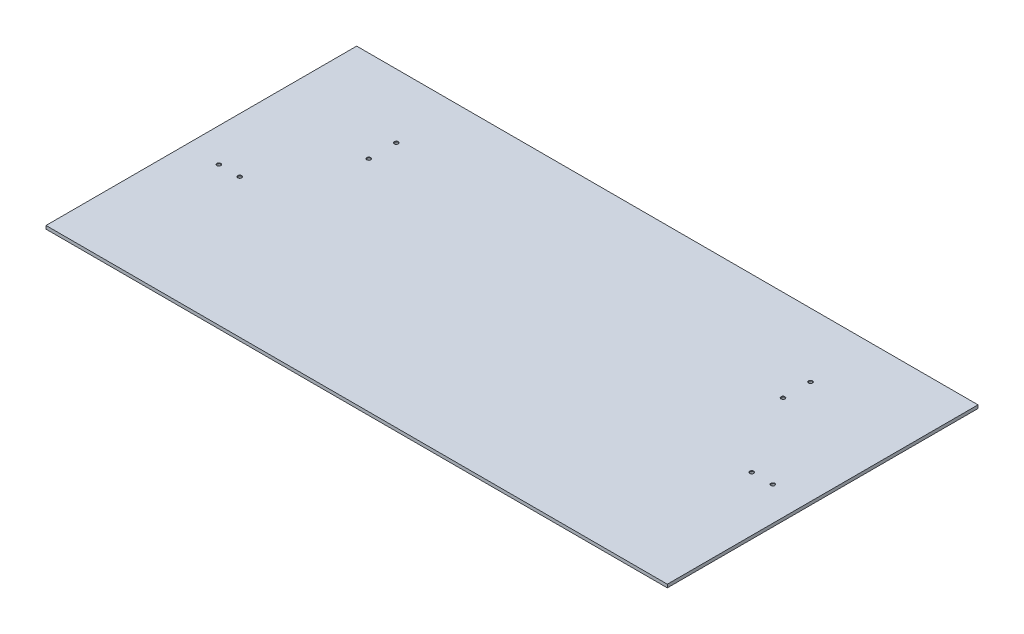
ISO-10303-21;
HEADER;
FILE_DESCRIPTION(('STEP AP214'),'2;1');
FILE_NAME('part.step','',(''),(''),'','','');
FILE_SCHEMA(('AUTOMOTIVE_DESIGN { 1 0 10303 214 1 1 1 1 }'));
ENDSEC;
DATA;
#1=APPLICATION_CONTEXT('core data for automotive mechanical design processes');
#2=APPLICATION_PROTOCOL_DEFINITION('international standard','automotive_design',2000,#1);
#3=PRODUCT_CONTEXT('',#1,'mechanical');
#4=PRODUCT('Part','Part','',(#3));
#5=PRODUCT_RELATED_PRODUCT_CATEGORY('part','',(#4));
#6=PRODUCT_DEFINITION_FORMATION('','',#4);
#7=PRODUCT_DEFINITION_CONTEXT('part definition',#1,'design');
#8=PRODUCT_DEFINITION('design','',#6,#7);
#9=PRODUCT_DEFINITION_SHAPE('','',#8);
#10=(LENGTH_UNIT() NAMED_UNIT(*) SI_UNIT(.MILLI.,.METRE.));
#11=(NAMED_UNIT(*) PLANE_ANGLE_UNIT() SI_UNIT($,.RADIAN.));
#12=(NAMED_UNIT(*) SI_UNIT($,.STERADIAN.) SOLID_ANGLE_UNIT());
#13=UNCERTAINTY_MEASURE_WITH_UNIT(LENGTH_MEASURE(1.E-05),#10,'distance_accuracy_value','');
#14=(GEOMETRIC_REPRESENTATION_CONTEXT(3) GLOBAL_UNCERTAINTY_ASSIGNED_CONTEXT((#13)) GLOBAL_UNIT_ASSIGNED_CONTEXT((#10,
#11,#12)) REPRESENTATION_CONTEXT('',''));
#15=CARTESIAN_POINT('',(0.,0.,0.));
#16=DIRECTION('',(0.,0.,1.));
#17=DIRECTION('',(1.,0.,0.));
#18=AXIS2_PLACEMENT_3D('',#15,#16,#17);
#19=CARTESIAN_POINT('',(0.,6.35,0.));
#20=DIRECTION('',(1.,0.,0.));
#21=DIRECTION('',(0.,0.,-1.));
#22=AXIS2_PLACEMENT_3D('',#19,#20,#21);
#23=PLANE('',#22);
#24=DIRECTION('',(0.,0.,1.));
#25=VECTOR('',#24,1.);
#26=CARTESIAN_POINT('',(0.,0.,0.));
#27=LINE('',#26,#25);
#28=CARTESIAN_POINT('',(0.,0.,-609.6));
#29=VERTEX_POINT('',#28);
#30=CARTESIAN_POINT('',(0.,0.,0.));
#31=VERTEX_POINT('',#30);
#32=EDGE_CURVE('E102',#29,#31,#27,.T.);
#33=ORIENTED_EDGE('',*,*,#32,.T.);
#34=DIRECTION('',(0.,-1.,0.));
#35=VECTOR('',#34,1.);
#36=CARTESIAN_POINT('',(0.,6.35,0.));
#37=LINE('',#36,#35);
#38=CARTESIAN_POINT('',(0.,6.35,0.));
#39=VERTEX_POINT('',#38);
#40=EDGE_CURVE('E11',#39,#31,#37,.T.);
#41=ORIENTED_EDGE('',*,*,#40,.F.);
#42=DIRECTION('',(0.,0.,1.));
#43=VECTOR('',#42,1.);
#44=CARTESIAN_POINT('',(0.,6.35,0.));
#45=LINE('',#44,#43);
#46=CARTESIAN_POINT('',(0.,6.35,-609.6));
#47=VERTEX_POINT('',#46);
#48=EDGE_CURVE('E90',#47,#39,#45,.T.);
#49=ORIENTED_EDGE('',*,*,#48,.F.);
#50=DIRECTION('',(0.,-1.,0.));
#51=VECTOR('',#50,1.);
#52=CARTESIAN_POINT('',(0.,6.35,-609.6));
#53=LINE('',#52,#51);
#54=EDGE_CURVE('E98',#47,#29,#53,.T.);
#55=ORIENTED_EDGE('',*,*,#54,.T.);
#56=EDGE_LOOP('',(#33,#41,#49,#55));
#57=FACE_BOUND('',#56,.T.);
#58=ADVANCED_FACE('F39',(#57),#23,.F.);
#59=CARTESIAN_POINT('',(0.,6.35,0.));
#60=DIRECTION('',(0.,0.,-1.));
#61=DIRECTION('',(-1.,0.,0.));
#62=AXIS2_PLACEMENT_3D('',#59,#60,#61);
#63=PLANE('',#62);
#64=DIRECTION('',(1.,0.,0.));
#65=VECTOR('',#64,1.);
#66=CARTESIAN_POINT('',(0.,0.,0.));
#67=LINE('',#66,#65);
#68=CARTESIAN_POINT('',(1219.2,0.,0.));
#69=VERTEX_POINT('',#68);
#70=EDGE_CURVE('E94',#31,#69,#67,.T.);
#71=ORIENTED_EDGE('',*,*,#70,.T.);
#72=DIRECTION('',(0.,-1.,0.));
#73=VECTOR('',#72,1.);
#74=CARTESIAN_POINT('',(1219.2,6.35,0.));
#75=LINE('',#74,#73);
#76=CARTESIAN_POINT('',(1219.2,6.35,0.));
#77=VERTEX_POINT('',#76);
#78=EDGE_CURVE('E47',#77,#69,#75,.T.);
#79=ORIENTED_EDGE('',*,*,#78,.F.);
#80=DIRECTION('',(1.,0.,0.));
#81=VECTOR('',#80,1.);
#82=CARTESIAN_POINT('',(0.,6.35,0.));
#83=LINE('',#82,#81);
#84=EDGE_CURVE('E85',#39,#77,#83,.T.);
#85=ORIENTED_EDGE('',*,*,#84,.F.);
#86=ORIENTED_EDGE('',*,*,#40,.T.);
#87=EDGE_LOOP('',(#71,#79,#85,#86));
#88=FACE_BOUND('',#87,.T.);
#89=ADVANCED_FACE('F93',(#88),#63,.F.);
#90=CARTESIAN_POINT('',(1219.2,6.35,0.));
#91=DIRECTION('',(-1.,0.,0.));
#92=DIRECTION('',(0.,0.,1.));
#93=AXIS2_PLACEMENT_3D('',#90,#91,#92);
#94=PLANE('',#93);
#95=DIRECTION('',(0.,0.,-1.));
#96=VECTOR('',#95,1.);
#97=CARTESIAN_POINT('',(1219.2,0.,0.));
#98=LINE('',#97,#96);
#99=CARTESIAN_POINT('',(1219.2,0.,-609.6));
#100=VERTEX_POINT('',#99);
#101=EDGE_CURVE('E72',#69,#100,#98,.T.);
#102=ORIENTED_EDGE('',*,*,#101,.T.);
#103=DIRECTION('',(0.,-1.,0.));
#104=VECTOR('',#103,1.);
#105=CARTESIAN_POINT('',(1219.2,6.35,-609.6));
#106=LINE('',#105,#104);
#107=CARTESIAN_POINT('',(1219.2,6.35,-609.6));
#108=VERTEX_POINT('',#107);
#109=EDGE_CURVE('E95',#108,#100,#106,.T.);
#110=ORIENTED_EDGE('',*,*,#109,.F.);
#111=DIRECTION('',(0.,0.,-1.));
#112=VECTOR('',#111,1.);
#113=CARTESIAN_POINT('',(1219.2,6.35,0.));
#114=LINE('',#113,#112);
#115=EDGE_CURVE('E88',#77,#108,#114,.T.);
#116=ORIENTED_EDGE('',*,*,#115,.F.);
#117=ORIENTED_EDGE('',*,*,#78,.T.);
#118=EDGE_LOOP('',(#102,#110,#116,#117));
#119=FACE_BOUND('',#118,.T.);
#120=ADVANCED_FACE('F96',(#119),#94,.F.);
#121=CARTESIAN_POINT('',(0.,6.35,-609.6));
#122=DIRECTION('',(0.,0.,1.));
#123=DIRECTION('',(1.,0.,0.));
#124=AXIS2_PLACEMENT_3D('',#121,#122,#123);
#125=PLANE('',#124);
#126=DIRECTION('',(-1.,0.,0.));
#127=VECTOR('',#126,1.);
#128=CARTESIAN_POINT('',(0.,0.,-609.6));
#129=LINE('',#128,#127);
#130=EDGE_CURVE('E78',#100,#29,#129,.T.);
#131=ORIENTED_EDGE('',*,*,#130,.T.);
#132=ORIENTED_EDGE('',*,*,#54,.F.);
#133=DIRECTION('',(-1.,0.,0.));
#134=VECTOR('',#133,1.);
#135=CARTESIAN_POINT('',(0.,6.35,-609.6));
#136=LINE('',#135,#134);
#137=EDGE_CURVE('E55',#108,#47,#136,.T.);
#138=ORIENTED_EDGE('',*,*,#137,.F.);
#139=ORIENTED_EDGE('',*,*,#109,.T.);
#140=EDGE_LOOP('',(#131,#132,#138,#139));
#141=FACE_BOUND('',#140,.T.);
#142=ADVANCED_FACE('F110',(#141),#125,.F.);
#143=CARTESIAN_POINT('',(0.,6.35,0.));
#144=DIRECTION('',(0.,-1.,0.));
#145=DIRECTION('',(0.,0.,-1.));
#146=AXIS2_PLACEMENT_3D('',#143,#144,#145);
#147=PLANE('',#146);
#148=CARTESIAN_POINT('',(66.0777190000001,6.35,-273.05));
#149=DIRECTION('',(0.,1.,0.));
#150=DIRECTION('',(0.,0.,1.));
#151=AXIS2_PLACEMENT_3D('',#148,#149,#150);
#152=CIRCLE('',#151,3.8989);
#153=CARTESIAN_POINT('',(66.0777190000001,6.35,-269.1511));
#154=VERTEX_POINT('',#153);
#155=EDGE_CURVE('E184',#154,#154,#152,.T.);
#156=ORIENTED_EDGE('',*,*,#155,.F.);
#157=EDGE_LOOP('',(#156));
#158=FACE_BOUND('',#157,.T.);
#159=CARTESIAN_POINT('',(107.352719,6.35,-273.05));
#160=DIRECTION('',(0.,1.,0.));
#161=DIRECTION('',(0.,0.,1.));
#162=AXIS2_PLACEMENT_3D('',#159,#160,#161);
#163=CIRCLE('',#162,3.8989);
#164=CARTESIAN_POINT('',(107.352719,6.35,-269.1511));
#165=VERTEX_POINT('',#164);
#166=EDGE_CURVE('E175',#165,#165,#163,.T.);
#167=ORIENTED_EDGE('',*,*,#166,.F.);
#168=EDGE_LOOP('',(#167));
#169=FACE_BOUND('',#168,.T.);
#170=CARTESIAN_POINT('',(203.2,6.35,-484.1875));
#171=DIRECTION('',(0.,1.,0.));
#172=DIRECTION('',(0.,0.,1.));
#173=AXIS2_PLACEMENT_3D('',#170,#171,#172);
#174=CIRCLE('',#173,3.89890000000001);
#175=CARTESIAN_POINT('',(203.2,6.35,-480.2886));
#176=VERTEX_POINT('',#175);
#177=EDGE_CURVE('E166',#176,#176,#174,.T.);
#178=ORIENTED_EDGE('',*,*,#177,.F.);
#179=EDGE_LOOP('',(#178));
#180=FACE_BOUND('',#179,.T.);
#181=CARTESIAN_POINT('',(203.2,6.35,-430.2125));
#182=DIRECTION('',(0.,1.,0.));
#183=DIRECTION('',(0.,0.,1.));
#184=AXIS2_PLACEMENT_3D('',#181,#182,#183);
#185=CIRCLE('',#184,3.89890000000001);
#186=CARTESIAN_POINT('',(203.2,6.35,-426.3136));
#187=VERTEX_POINT('',#186);
#188=EDGE_CURVE('E157',#187,#187,#185,.T.);
#189=ORIENTED_EDGE('',*,*,#188,.F.);
#190=EDGE_LOOP('',(#189));
#191=FACE_BOUND('',#190,.T.);
#192=CARTESIAN_POINT('',(1016.,6.35,-484.1875));
#193=DIRECTION('',(0.,1.,0.));
#194=DIRECTION('',(0.,0.,1.));
#195=AXIS2_PLACEMENT_3D('',#192,#193,#194);
#196=CIRCLE('',#195,3.89890000000004);
#197=CARTESIAN_POINT('',(1016.,6.35,-480.2886));
#198=VERTEX_POINT('',#197);
#199=EDGE_CURVE('E148',#198,#198,#196,.T.);
#200=ORIENTED_EDGE('',*,*,#199,.F.);
#201=EDGE_LOOP('',(#200));
#202=FACE_BOUND('',#201,.T.);
#203=CARTESIAN_POINT('',(1016.,6.35,-430.2125));
#204=DIRECTION('',(0.,1.,0.));
#205=DIRECTION('',(0.,0.,1.));
#206=AXIS2_PLACEMENT_3D('',#203,#204,#205);
#207=CIRCLE('',#206,3.89890000000004);
#208=CARTESIAN_POINT('',(1016.,6.35,-426.3136));
#209=VERTEX_POINT('',#208);
#210=EDGE_CURVE('E139',#209,#209,#207,.T.);
#211=ORIENTED_EDGE('',*,*,#210,.F.);
#212=EDGE_LOOP('',(#211));
#213=FACE_BOUND('',#212,.T.);
#214=CARTESIAN_POINT('',(1111.847281,6.35,-273.05));
#215=DIRECTION('',(0.,1.,0.));
#216=DIRECTION('',(0.,0.,1.));
#217=AXIS2_PLACEMENT_3D('',#214,#215,#216);
#218=CIRCLE('',#217,3.89890000000004);
#219=CARTESIAN_POINT('',(1111.847281,6.35,-269.1511));
#220=VERTEX_POINT('',#219);
#221=EDGE_CURVE('E130',#220,#220,#218,.T.);
#222=ORIENTED_EDGE('',*,*,#221,.F.);
#223=EDGE_LOOP('',(#222));
#224=FACE_BOUND('',#223,.T.);
#225=CARTESIAN_POINT('',(1153.122281,6.35,-273.05));
#226=DIRECTION('',(0.,1.,0.));
#227=DIRECTION('',(0.,0.,1.));
#228=AXIS2_PLACEMENT_3D('',#225,#226,#227);
#229=CIRCLE('',#228,3.89890000000004);
#230=CARTESIAN_POINT('',(1153.122281,6.35,-269.1511));
#231=VERTEX_POINT('',#230);
#232=EDGE_CURVE('E121',#231,#231,#229,.T.);
#233=ORIENTED_EDGE('',*,*,#232,.F.);
#234=EDGE_LOOP('',(#233));
#235=FACE_BOUND('',#234,.T.);
#236=ORIENTED_EDGE('',*,*,#48,.T.);
#237=ORIENTED_EDGE('',*,*,#84,.T.);
#238=ORIENTED_EDGE('',*,*,#115,.T.);
#239=ORIENTED_EDGE('',*,*,#137,.T.);
#240=EDGE_LOOP('',(#236,#237,#238,#239));
#241=FACE_BOUND('',#240,.T.);
#242=ADVANCED_FACE('F86',(#158,#169,#180,#191,#202,#213,#224,#235,#241),#147,.F.);
#243=CARTESIAN_POINT('',(0.,0.,0.));
#244=DIRECTION('',(0.,-1.,0.));
#245=DIRECTION('',(0.,0.,-1.));
#246=AXIS2_PLACEMENT_3D('',#243,#244,#245);
#247=PLANE('',#246);
#248=CARTESIAN_POINT('',(66.0777190000001,0.,-273.05));
#249=DIRECTION('',(0.,1.,0.));
#250=DIRECTION('',(0.,0.,1.));
#251=AXIS2_PLACEMENT_3D('',#248,#249,#250);
#252=CIRCLE('',#251,3.175);
#253=CARTESIAN_POINT('',(66.0777190000001,0.,-269.875));
#254=VERTEX_POINT('',#253);
#255=EDGE_CURVE('E178',#254,#254,#252,.T.);
#256=ORIENTED_EDGE('',*,*,#255,.T.);
#257=EDGE_LOOP('',(#256));
#258=FACE_BOUND('',#257,.T.);
#259=CARTESIAN_POINT('',(107.352719,0.,-273.05));
#260=DIRECTION('',(0.,1.,0.));
#261=DIRECTION('',(0.,0.,1.));
#262=AXIS2_PLACEMENT_3D('',#259,#260,#261);
#263=CIRCLE('',#262,3.175);
#264=CARTESIAN_POINT('',(107.352719,0.,-269.875));
#265=VERTEX_POINT('',#264);
#266=EDGE_CURVE('E169',#265,#265,#263,.T.);
#267=ORIENTED_EDGE('',*,*,#266,.T.);
#268=EDGE_LOOP('',(#267));
#269=FACE_BOUND('',#268,.T.);
#270=CARTESIAN_POINT('',(203.2,0.,-484.1875));
#271=DIRECTION('',(0.,1.,0.));
#272=DIRECTION('',(0.,0.,1.));
#273=AXIS2_PLACEMENT_3D('',#270,#271,#272);
#274=CIRCLE('',#273,3.17500000000001);
#275=CARTESIAN_POINT('',(203.2,0.,-481.0125));
#276=VERTEX_POINT('',#275);
#277=EDGE_CURVE('E160',#276,#276,#274,.T.);
#278=ORIENTED_EDGE('',*,*,#277,.T.);
#279=EDGE_LOOP('',(#278));
#280=FACE_BOUND('',#279,.T.);
#281=CARTESIAN_POINT('',(203.2,0.,-430.2125));
#282=DIRECTION('',(0.,1.,0.));
#283=DIRECTION('',(0.,0.,1.));
#284=AXIS2_PLACEMENT_3D('',#281,#282,#283);
#285=CIRCLE('',#284,3.17500000000001);
#286=CARTESIAN_POINT('',(203.2,0.,-427.0375));
#287=VERTEX_POINT('',#286);
#288=EDGE_CURVE('E151',#287,#287,#285,.T.);
#289=ORIENTED_EDGE('',*,*,#288,.T.);
#290=EDGE_LOOP('',(#289));
#291=FACE_BOUND('',#290,.T.);
#292=CARTESIAN_POINT('',(1016.,0.,-484.1875));
#293=DIRECTION('',(0.,1.,0.));
#294=DIRECTION('',(0.,0.,1.));
#295=AXIS2_PLACEMENT_3D('',#292,#293,#294);
#296=CIRCLE('',#295,3.17499999999993);
#297=CARTESIAN_POINT('',(1016.,0.,-481.0125));
#298=VERTEX_POINT('',#297);
#299=EDGE_CURVE('E142',#298,#298,#296,.T.);
#300=ORIENTED_EDGE('',*,*,#299,.T.);
#301=EDGE_LOOP('',(#300));
#302=FACE_BOUND('',#301,.T.);
#303=CARTESIAN_POINT('',(1016.,0.,-430.2125));
#304=DIRECTION('',(0.,1.,0.));
#305=DIRECTION('',(0.,0.,1.));
#306=AXIS2_PLACEMENT_3D('',#303,#304,#305);
#307=CIRCLE('',#306,3.17499999999993);
#308=CARTESIAN_POINT('',(1016.,0.,-427.0375));
#309=VERTEX_POINT('',#308);
#310=EDGE_CURVE('E133',#309,#309,#307,.T.);
#311=ORIENTED_EDGE('',*,*,#310,.T.);
#312=EDGE_LOOP('',(#311));
#313=FACE_BOUND('',#312,.T.);
#314=CARTESIAN_POINT('',(1111.847281,0.,-273.05));
#315=DIRECTION('',(0.,1.,0.));
#316=DIRECTION('',(0.,0.,1.));
#317=AXIS2_PLACEMENT_3D('',#314,#315,#316);
#318=CIRCLE('',#317,3.17499999999993);
#319=CARTESIAN_POINT('',(1111.847281,0.,-269.875));
#320=VERTEX_POINT('',#319);
#321=EDGE_CURVE('E124',#320,#320,#318,.T.);
#322=ORIENTED_EDGE('',*,*,#321,.T.);
#323=EDGE_LOOP('',(#322));
#324=FACE_BOUND('',#323,.T.);
#325=CARTESIAN_POINT('',(1153.122281,0.,-273.05));
#326=DIRECTION('',(0.,1.,0.));
#327=DIRECTION('',(0.,0.,1.));
#328=AXIS2_PLACEMENT_3D('',#325,#326,#327);
#329=CIRCLE('',#328,3.17499999999993);
#330=CARTESIAN_POINT('',(1153.122281,0.,-269.875));
#331=VERTEX_POINT('',#330);
#332=EDGE_CURVE('E105',#331,#331,#329,.T.);
#333=ORIENTED_EDGE('',*,*,#332,.T.);
#334=EDGE_LOOP('',(#333));
#335=FACE_BOUND('',#334,.T.);
#336=ORIENTED_EDGE('',*,*,#32,.F.);
#337=ORIENTED_EDGE('',*,*,#130,.F.);
#338=ORIENTED_EDGE('',*,*,#101,.F.);
#339=ORIENTED_EDGE('',*,*,#70,.F.);
#340=EDGE_LOOP('',(#336,#337,#338,#339));
#341=FACE_BOUND('',#340,.T.);
#342=ADVANCED_FACE('F113',(#258,#269,#280,#291,#302,#313,#324,#335,#341),#247,.T.);
#343=CARTESIAN_POINT('',(1153.122281,6.35,-273.05));
#344=DIRECTION('',(0.,1.,0.));
#345=DIRECTION('',(0.,0.,1.));
#346=AXIS2_PLACEMENT_3D('',#343,#344,#345);
#347=CYLINDRICAL_SURFACE('',#346,3.17499999999993);
#348=ORIENTED_EDGE('',*,*,#332,.F.);
#349=EDGE_LOOP('',(#348));
#350=FACE_BOUND('',#349,.T.);
#351=CARTESIAN_POINT('',(1153.122281,5.74257577699077,-273.05));
#352=DIRECTION('',(0.,1.,0.));
#353=DIRECTION('',(0.,0.,1.));
#354=AXIS2_PLACEMENT_3D('',#351,#352,#353);
#355=CIRCLE('',#354,3.17499999999993);
#356=CARTESIAN_POINT('',(1153.122281,5.74257577699077,-269.875));
#357=VERTEX_POINT('',#356);
#358=EDGE_CURVE('E118',#357,#357,#355,.T.);
#359=ORIENTED_EDGE('',*,*,#358,.T.);
#360=EDGE_LOOP('',(#359));
#361=FACE_BOUND('',#360,.T.);
#362=ADVANCED_FACE('F210',(#350,#361),#347,.F.);
#363=CARTESIAN_POINT('',(1153.122281,6.35,-273.05));
#364=DIRECTION('',(0.,1.,0.));
#365=DIRECTION('',(0.,0.,1.));
#366=AXIS2_PLACEMENT_3D('',#363,#364,#365);
#367=CONICAL_SURFACE('',#366,3.89890000000004,0.87266462599724);
#368=ORIENTED_EDGE('',*,*,#358,.F.);
#369=EDGE_LOOP('',(#368));
#370=FACE_BOUND('',#369,.T.);
#371=ORIENTED_EDGE('',*,*,#232,.T.);
#372=EDGE_LOOP('',(#371));
#373=FACE_BOUND('',#372,.T.);
#374=ADVANCED_FACE('F207',(#370,#373),#367,.F.);
#375=CARTESIAN_POINT('',(1111.847281,6.35,-273.05));
#376=DIRECTION('',(0.,1.,0.));
#377=DIRECTION('',(0.,0.,1.));
#378=AXIS2_PLACEMENT_3D('',#375,#376,#377);
#379=CYLINDRICAL_SURFACE('',#378,3.17499999999993);
#380=ORIENTED_EDGE('',*,*,#321,.F.);
#381=EDGE_LOOP('',(#380));
#382=FACE_BOUND('',#381,.T.);
#383=CARTESIAN_POINT('',(1111.847281,5.74257577699077,-273.05));
#384=DIRECTION('',(0.,1.,0.));
#385=DIRECTION('',(0.,0.,1.));
#386=AXIS2_PLACEMENT_3D('',#383,#384,#385);
#387=CIRCLE('',#386,3.17499999999993);
#388=CARTESIAN_POINT('',(1111.847281,5.74257577699077,-269.875));
#389=VERTEX_POINT('',#388);
#390=EDGE_CURVE('E127',#389,#389,#387,.T.);
#391=ORIENTED_EDGE('',*,*,#390,.T.);
#392=EDGE_LOOP('',(#391));
#393=FACE_BOUND('',#392,.T.);
#394=ADVANCED_FACE('F209',(#382,#393),#379,.F.);
#395=CARTESIAN_POINT('',(1111.847281,6.35,-273.05));
#396=DIRECTION('',(0.,1.,0.));
#397=DIRECTION('',(0.,0.,1.));
#398=AXIS2_PLACEMENT_3D('',#395,#396,#397);
#399=CONICAL_SURFACE('',#398,3.89890000000004,0.87266462599724);
#400=ORIENTED_EDGE('',*,*,#390,.F.);
#401=EDGE_LOOP('',(#400));
#402=FACE_BOUND('',#401,.T.);
#403=ORIENTED_EDGE('',*,*,#221,.T.);
#404=EDGE_LOOP('',(#403));
#405=FACE_BOUND('',#404,.T.);
#406=ADVANCED_FACE('F217',(#402,#405),#399,.F.);
#407=CARTESIAN_POINT('',(1016.,6.35,-430.2125));
#408=DIRECTION('',(0.,1.,0.));
#409=DIRECTION('',(0.,0.,1.));
#410=AXIS2_PLACEMENT_3D('',#407,#408,#409);
#411=CYLINDRICAL_SURFACE('',#410,3.17499999999993);
#412=ORIENTED_EDGE('',*,*,#310,.F.);
#413=EDGE_LOOP('',(#412));
#414=FACE_BOUND('',#413,.T.);
#415=CARTESIAN_POINT('',(1016.,5.74257577699077,-430.2125));
#416=DIRECTION('',(0.,1.,0.));
#417=DIRECTION('',(0.,0.,1.));
#418=AXIS2_PLACEMENT_3D('',#415,#416,#417);
#419=CIRCLE('',#418,3.17499999999993);
#420=CARTESIAN_POINT('',(1016.,5.74257577699077,-427.0375));
#421=VERTEX_POINT('',#420);
#422=EDGE_CURVE('E136',#421,#421,#419,.T.);
#423=ORIENTED_EDGE('',*,*,#422,.T.);
#424=EDGE_LOOP('',(#423));
#425=FACE_BOUND('',#424,.T.);
#426=ADVANCED_FACE('F260',(#414,#425),#411,.F.);
#427=CARTESIAN_POINT('',(1016.,6.35,-430.2125));
#428=DIRECTION('',(0.,1.,0.));
#429=DIRECTION('',(0.,0.,1.));
#430=AXIS2_PLACEMENT_3D('',#427,#428,#429);
#431=CONICAL_SURFACE('',#430,3.89890000000004,0.87266462599724);
#432=ORIENTED_EDGE('',*,*,#422,.F.);
#433=EDGE_LOOP('',(#432));
#434=FACE_BOUND('',#433,.T.);
#435=ORIENTED_EDGE('',*,*,#210,.T.);
#436=EDGE_LOOP('',(#435));
#437=FACE_BOUND('',#436,.T.);
#438=ADVANCED_FACE('F265',(#434,#437),#431,.F.);
#439=CARTESIAN_POINT('',(1016.,6.35,-484.1875));
#440=DIRECTION('',(0.,1.,0.));
#441=DIRECTION('',(0.,0.,1.));
#442=AXIS2_PLACEMENT_3D('',#439,#440,#441);
#443=CYLINDRICAL_SURFACE('',#442,3.17499999999993);
#444=ORIENTED_EDGE('',*,*,#299,.F.);
#445=EDGE_LOOP('',(#444));
#446=FACE_BOUND('',#445,.T.);
#447=CARTESIAN_POINT('',(1016.,5.74257577699077,-484.1875));
#448=DIRECTION('',(0.,1.,0.));
#449=DIRECTION('',(0.,0.,1.));
#450=AXIS2_PLACEMENT_3D('',#447,#448,#449);
#451=CIRCLE('',#450,3.17499999999993);
#452=CARTESIAN_POINT('',(1016.,5.74257577699077,-481.0125));
#453=VERTEX_POINT('',#452);
#454=EDGE_CURVE('E145',#453,#453,#451,.T.);
#455=ORIENTED_EDGE('',*,*,#454,.T.);
#456=EDGE_LOOP('',(#455));
#457=FACE_BOUND('',#456,.T.);
#458=ADVANCED_FACE('F271',(#446,#457),#443,.F.);
#459=CARTESIAN_POINT('',(1016.,6.35,-484.1875));
#460=DIRECTION('',(0.,1.,0.));
#461=DIRECTION('',(0.,0.,1.));
#462=AXIS2_PLACEMENT_3D('',#459,#460,#461);
#463=CONICAL_SURFACE('',#462,3.89890000000004,0.87266462599724);
#464=ORIENTED_EDGE('',*,*,#454,.F.);
#465=EDGE_LOOP('',(#464));
#466=FACE_BOUND('',#465,.T.);
#467=ORIENTED_EDGE('',*,*,#199,.T.);
#468=EDGE_LOOP('',(#467));
#469=FACE_BOUND('',#468,.T.);
#470=ADVANCED_FACE('F275',(#466,#469),#463,.F.);
#471=CARTESIAN_POINT('',(203.2,6.35,-430.2125));
#472=DIRECTION('',(0.,1.,0.));
#473=DIRECTION('',(0.,0.,1.));
#474=AXIS2_PLACEMENT_3D('',#471,#472,#473);
#475=CYLINDRICAL_SURFACE('',#474,3.17500000000001);
#476=ORIENTED_EDGE('',*,*,#288,.F.);
#477=EDGE_LOOP('',(#476));
#478=FACE_BOUND('',#477,.T.);
#479=CARTESIAN_POINT('',(203.2,5.74257577699077,-430.2125));
#480=DIRECTION('',(0.,1.,0.));
#481=DIRECTION('',(0.,0.,1.));
#482=AXIS2_PLACEMENT_3D('',#479,#480,#481);
#483=CIRCLE('',#482,3.17500000000001);
#484=CARTESIAN_POINT('',(203.2,5.74257577699077,-427.0375));
#485=VERTEX_POINT('',#484);
#486=EDGE_CURVE('E154',#485,#485,#483,.T.);
#487=ORIENTED_EDGE('',*,*,#486,.T.);
#488=EDGE_LOOP('',(#487));
#489=FACE_BOUND('',#488,.T.);
#490=ADVANCED_FACE('F279',(#478,#489),#475,.F.);
#491=CARTESIAN_POINT('',(203.2,6.35,-430.2125));
#492=DIRECTION('',(0.,1.,0.));
#493=DIRECTION('',(0.,0.,1.));
#494=AXIS2_PLACEMENT_3D('',#491,#492,#493);
#495=CONICAL_SURFACE('',#494,3.89890000000001,0.872664625997164);
#496=ORIENTED_EDGE('',*,*,#486,.F.);
#497=EDGE_LOOP('',(#496));
#498=FACE_BOUND('',#497,.T.);
#499=ORIENTED_EDGE('',*,*,#188,.T.);
#500=EDGE_LOOP('',(#499));
#501=FACE_BOUND('',#500,.T.);
#502=ADVANCED_FACE('F283',(#498,#501),#495,.F.);
#503=CARTESIAN_POINT('',(203.2,6.35,-484.1875));
#504=DIRECTION('',(0.,1.,0.));
#505=DIRECTION('',(0.,0.,1.));
#506=AXIS2_PLACEMENT_3D('',#503,#504,#505);
#507=CYLINDRICAL_SURFACE('',#506,3.17500000000001);
#508=ORIENTED_EDGE('',*,*,#277,.F.);
#509=EDGE_LOOP('',(#508));
#510=FACE_BOUND('',#509,.T.);
#511=CARTESIAN_POINT('',(203.2,5.74257577699077,-484.1875));
#512=DIRECTION('',(0.,1.,0.));
#513=DIRECTION('',(0.,0.,1.));
#514=AXIS2_PLACEMENT_3D('',#511,#512,#513);
#515=CIRCLE('',#514,3.17500000000001);
#516=CARTESIAN_POINT('',(203.2,5.74257577699077,-481.0125));
#517=VERTEX_POINT('',#516);
#518=EDGE_CURVE('E163',#517,#517,#515,.T.);
#519=ORIENTED_EDGE('',*,*,#518,.T.);
#520=EDGE_LOOP('',(#519));
#521=FACE_BOUND('',#520,.T.);
#522=ADVANCED_FACE('F287',(#510,#521),#507,.F.);
#523=CARTESIAN_POINT('',(203.2,6.35,-484.1875));
#524=DIRECTION('',(0.,1.,0.));
#525=DIRECTION('',(0.,0.,1.));
#526=AXIS2_PLACEMENT_3D('',#523,#524,#525);
#527=CONICAL_SURFACE('',#526,3.89890000000001,0.872664625997164);
#528=ORIENTED_EDGE('',*,*,#518,.F.);
#529=EDGE_LOOP('',(#528));
#530=FACE_BOUND('',#529,.T.);
#531=ORIENTED_EDGE('',*,*,#177,.T.);
#532=EDGE_LOOP('',(#531));
#533=FACE_BOUND('',#532,.T.);
#534=ADVANCED_FACE('F291',(#530,#533),#527,.F.);
#535=CARTESIAN_POINT('',(107.352719,6.35,-273.05));
#536=DIRECTION('',(0.,1.,0.));
#537=DIRECTION('',(0.,0.,1.));
#538=AXIS2_PLACEMENT_3D('',#535,#536,#537);
#539=CYLINDRICAL_SURFACE('',#538,3.175);
#540=ORIENTED_EDGE('',*,*,#266,.F.);
#541=EDGE_LOOP('',(#540));
#542=FACE_BOUND('',#541,.T.);
#543=CARTESIAN_POINT('',(107.352719,5.74257577699077,-273.05));
#544=DIRECTION('',(0.,1.,0.));
#545=DIRECTION('',(0.,0.,1.));
#546=AXIS2_PLACEMENT_3D('',#543,#544,#545);
#547=CIRCLE('',#546,3.175);
#548=CARTESIAN_POINT('',(107.352719,5.74257577699077,-269.875));
#549=VERTEX_POINT('',#548);
#550=EDGE_CURVE('E172',#549,#549,#547,.T.);
#551=ORIENTED_EDGE('',*,*,#550,.T.);
#552=EDGE_LOOP('',(#551));
#553=FACE_BOUND('',#552,.T.);
#554=ADVANCED_FACE('F295',(#542,#553),#539,.F.);
#555=CARTESIAN_POINT('',(107.352719,6.35,-273.05));
#556=DIRECTION('',(0.,1.,0.));
#557=DIRECTION('',(0.,0.,1.));
#558=AXIS2_PLACEMENT_3D('',#555,#556,#557);
#559=CONICAL_SURFACE('',#558,3.8989,0.872664625997164);
#560=ORIENTED_EDGE('',*,*,#550,.F.);
#561=EDGE_LOOP('',(#560));
#562=FACE_BOUND('',#561,.T.);
#563=ORIENTED_EDGE('',*,*,#166,.T.);
#564=EDGE_LOOP('',(#563));
#565=FACE_BOUND('',#564,.T.);
#566=ADVANCED_FACE('F299',(#562,#565),#559,.F.);
#567=CARTESIAN_POINT('',(66.0777190000001,6.35,-273.05));
#568=DIRECTION('',(0.,1.,0.));
#569=DIRECTION('',(0.,0.,1.));
#570=AXIS2_PLACEMENT_3D('',#567,#568,#569);
#571=CYLINDRICAL_SURFACE('',#570,3.175);
#572=ORIENTED_EDGE('',*,*,#255,.F.);
#573=EDGE_LOOP('',(#572));
#574=FACE_BOUND('',#573,.T.);
#575=CARTESIAN_POINT('',(66.0777190000001,5.74257577699077,-273.05));
#576=DIRECTION('',(0.,1.,0.));
#577=DIRECTION('',(0.,0.,1.));
#578=AXIS2_PLACEMENT_3D('',#575,#576,#577);
#579=CIRCLE('',#578,3.175);
#580=CARTESIAN_POINT('',(66.0777190000001,5.74257577699077,-269.875));
#581=VERTEX_POINT('',#580);
#582=EDGE_CURVE('E181',#581,#581,#579,.T.);
#583=ORIENTED_EDGE('',*,*,#582,.T.);
#584=EDGE_LOOP('',(#583));
#585=FACE_BOUND('',#584,.T.);
#586=ADVANCED_FACE('F303',(#574,#585),#571,.F.);
#587=CARTESIAN_POINT('',(66.0777190000001,6.35,-273.05));
#588=DIRECTION('',(0.,1.,0.));
#589=DIRECTION('',(0.,0.,1.));
#590=AXIS2_PLACEMENT_3D('',#587,#588,#589);
#591=CONICAL_SURFACE('',#590,3.8989,0.872664625997164);
#592=ORIENTED_EDGE('',*,*,#582,.F.);
#593=EDGE_LOOP('',(#592));
#594=FACE_BOUND('',#593,.T.);
#595=ORIENTED_EDGE('',*,*,#155,.T.);
#596=EDGE_LOOP('',(#595));
#597=FACE_BOUND('',#596,.T.);
#598=ADVANCED_FACE('F188',(#594,#597),#591,.F.);
#599=CLOSED_SHELL('',(#58,#89,#120,#142,#242,#342,#362,#374,#394,#406,#426,#438,#458,#470,#490,
#502,#522,#534,#554,#566,#586,#598));
#600=MANIFOLD_SOLID_BREP('B2',#599);
#601=ADVANCED_BREP_SHAPE_REPRESENTATION('',(#18,#600),#14);
#602=SHAPE_DEFINITION_REPRESENTATION(#9,#601);
ENDSEC;
END-ISO-10303-21;
